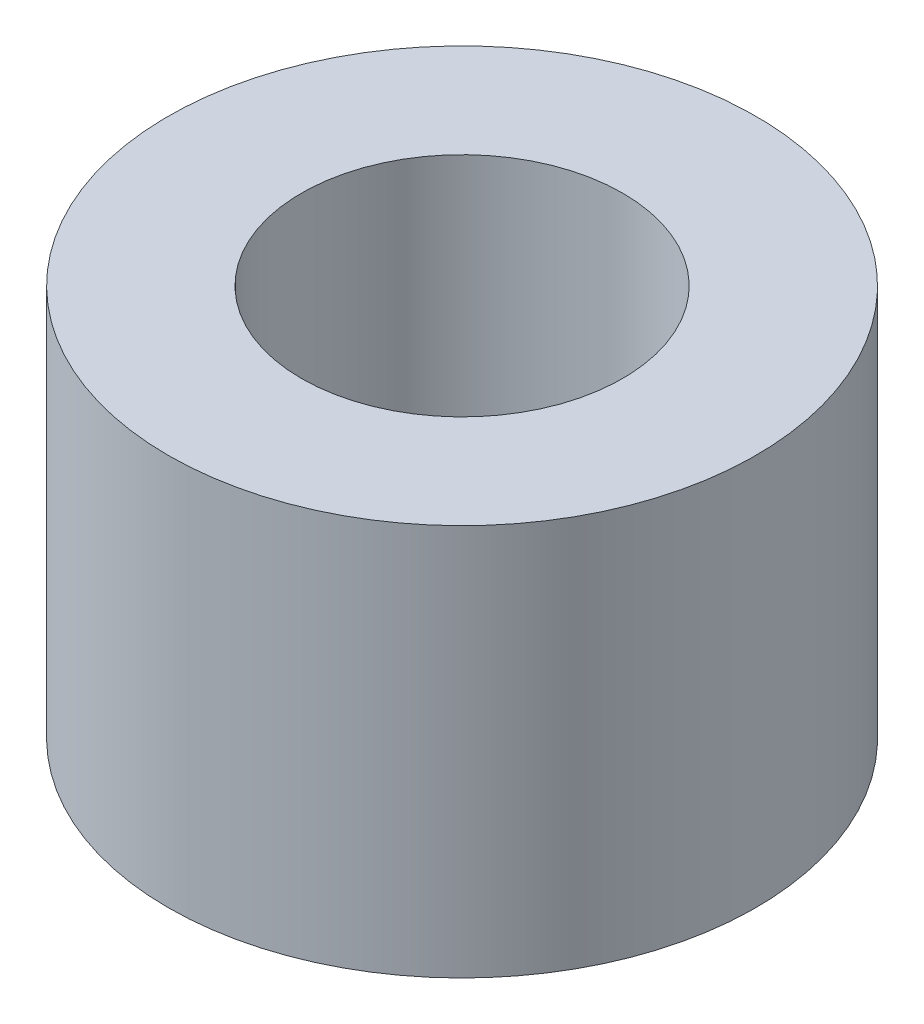
ISO-10303-21;
HEADER;
FILE_DESCRIPTION(('STEP AP214'),'2;1');
FILE_NAME('part.step','',(''),(''),'','','');
FILE_SCHEMA(('AUTOMOTIVE_DESIGN { 1 0 10303 214 1 1 1 1 }'));
ENDSEC;
DATA;
#1=APPLICATION_CONTEXT('core data for automotive mechanical design processes');
#2=APPLICATION_PROTOCOL_DEFINITION('international standard','automotive_design',2000,#1);
#3=PRODUCT_CONTEXT('',#1,'mechanical');
#4=PRODUCT('Part','Part','',(#3));
#5=PRODUCT_RELATED_PRODUCT_CATEGORY('part','',(#4));
#6=PRODUCT_DEFINITION_FORMATION('','',#4);
#7=PRODUCT_DEFINITION_CONTEXT('part definition',#1,'design');
#8=PRODUCT_DEFINITION('design','',#6,#7);
#9=PRODUCT_DEFINITION_SHAPE('','',#8);
#10=(LENGTH_UNIT() NAMED_UNIT(*) SI_UNIT(.MILLI.,.METRE.));
#11=(NAMED_UNIT(*) PLANE_ANGLE_UNIT() SI_UNIT($,.RADIAN.));
#12=(NAMED_UNIT(*) SI_UNIT($,.STERADIAN.) SOLID_ANGLE_UNIT());
#13=UNCERTAINTY_MEASURE_WITH_UNIT(LENGTH_MEASURE(1.E-05),#10,'distance_accuracy_value','');
#14=(GEOMETRIC_REPRESENTATION_CONTEXT(3) GLOBAL_UNCERTAINTY_ASSIGNED_CONTEXT((#13)) GLOBAL_UNIT_ASSIGNED_CONTEXT((#10,
#11,#12)) REPRESENTATION_CONTEXT('',''));
#15=CARTESIAN_POINT('',(0.,0.,0.));
#16=DIRECTION('',(0.,0.,1.));
#17=DIRECTION('',(1.,0.,0.));
#18=AXIS2_PLACEMENT_3D('',#15,#16,#17);
#19=CARTESIAN_POINT('',(0.,5.,0.));
#20=DIRECTION('',(0.,1.,0.));
#21=DIRECTION('',(0.,0.,1.));
#22=AXIS2_PLACEMENT_3D('',#19,#20,#21);
#23=PLANE('',#22);
#24=CARTESIAN_POINT('',(0.,5.,0.));
#25=DIRECTION('',(0.,1.,0.));
#26=DIRECTION('',(0.,0.,1.));
#27=AXIS2_PLACEMENT_3D('',#24,#25,#26);
#28=CIRCLE('',#27,3.75);
#29=CARTESIAN_POINT('',(0.,5.,3.75));
#30=VERTEX_POINT('',#29);
#31=EDGE_CURVE('E10',#30,#30,#28,.T.);
#32=ORIENTED_EDGE('',*,*,#31,.T.);
#33=EDGE_LOOP('',(#32));
#34=FACE_BOUND('',#33,.T.);
#35=CARTESIAN_POINT('',(0.,5.,0.));
#36=DIRECTION('',(0.,1.,0.));
#37=DIRECTION('',(0.,0.,1.));
#38=AXIS2_PLACEMENT_3D('',#35,#36,#37);
#39=CIRCLE('',#38,2.05);
#40=CARTESIAN_POINT('',(0.,5.,2.05));
#41=VERTEX_POINT('',#40);
#42=EDGE_CURVE('E42',#41,#41,#39,.T.);
#43=ORIENTED_EDGE('',*,*,#42,.F.);
#44=EDGE_LOOP('',(#43));
#45=FACE_BOUND('',#44,.T.);
#46=ADVANCED_FACE('F31',(#34,#45),#23,.T.);
#47=CARTESIAN_POINT('',(0.,0.,0.));
#48=DIRECTION('',(0.,1.,0.));
#49=DIRECTION('',(0.,0.,1.));
#50=AXIS2_PLACEMENT_3D('',#47,#48,#49);
#51=PLANE('',#50);
#52=CARTESIAN_POINT('',(0.,0.,0.));
#53=DIRECTION('',(0.,1.,0.));
#54=DIRECTION('',(0.,0.,1.));
#55=AXIS2_PLACEMENT_3D('',#52,#53,#54);
#56=CIRCLE('',#55,3.75);
#57=CARTESIAN_POINT('',(0.,0.,3.75));
#58=VERTEX_POINT('',#57);
#59=EDGE_CURVE('E35',#58,#58,#56,.T.);
#60=ORIENTED_EDGE('',*,*,#59,.F.);
#61=EDGE_LOOP('',(#60));
#62=FACE_BOUND('',#61,.T.);
#63=CARTESIAN_POINT('',(0.,0.,0.));
#64=DIRECTION('',(0.,1.,0.));
#65=DIRECTION('',(0.,0.,1.));
#66=AXIS2_PLACEMENT_3D('',#63,#64,#65);
#67=CIRCLE('',#66,2.05);
#68=CARTESIAN_POINT('',(0.,0.,2.05));
#69=VERTEX_POINT('',#68);
#70=EDGE_CURVE('E44',#69,#69,#67,.T.);
#71=ORIENTED_EDGE('',*,*,#70,.T.);
#72=EDGE_LOOP('',(#71));
#73=FACE_BOUND('',#72,.T.);
#74=ADVANCED_FACE('F54',(#62,#73),#51,.F.);
#75=CARTESIAN_POINT('',(0.,5.,0.));
#76=DIRECTION('',(0.,-1.,0.));
#77=DIRECTION('',(0.,0.,-1.));
#78=AXIS2_PLACEMENT_3D('',#75,#76,#77);
#79=CYLINDRICAL_SURFACE('',#78,3.75);
#80=ORIENTED_EDGE('',*,*,#31,.F.);
#81=EDGE_LOOP('',(#80));
#82=FACE_BOUND('',#81,.T.);
#83=ORIENTED_EDGE('',*,*,#59,.T.);
#84=EDGE_LOOP('',(#83));
#85=FACE_BOUND('',#84,.T.);
#86=ADVANCED_FACE('F33',(#82,#85),#79,.T.);
#87=CARTESIAN_POINT('',(0.,5.,0.));
#88=DIRECTION('',(0.,-1.,0.));
#89=DIRECTION('',(0.,0.,-1.));
#90=AXIS2_PLACEMENT_3D('',#87,#88,#89);
#91=CYLINDRICAL_SURFACE('',#90,2.05);
#92=ORIENTED_EDGE('',*,*,#42,.T.);
#93=EDGE_LOOP('',(#92));
#94=FACE_BOUND('',#93,.T.);
#95=ORIENTED_EDGE('',*,*,#70,.F.);
#96=EDGE_LOOP('',(#95));
#97=FACE_BOUND('',#96,.T.);
#98=ADVANCED_FACE('F50',(#94,#97),#91,.F.);
#99=CLOSED_SHELL('',(#46,#74,#86,#98));
#100=MANIFOLD_SOLID_BREP('B2',#99);
#101=ADVANCED_BREP_SHAPE_REPRESENTATION('',(#18,#100),#14);
#102=SHAPE_DEFINITION_REPRESENTATION(#9,#101);
ENDSEC;
END-ISO-10303-21;
